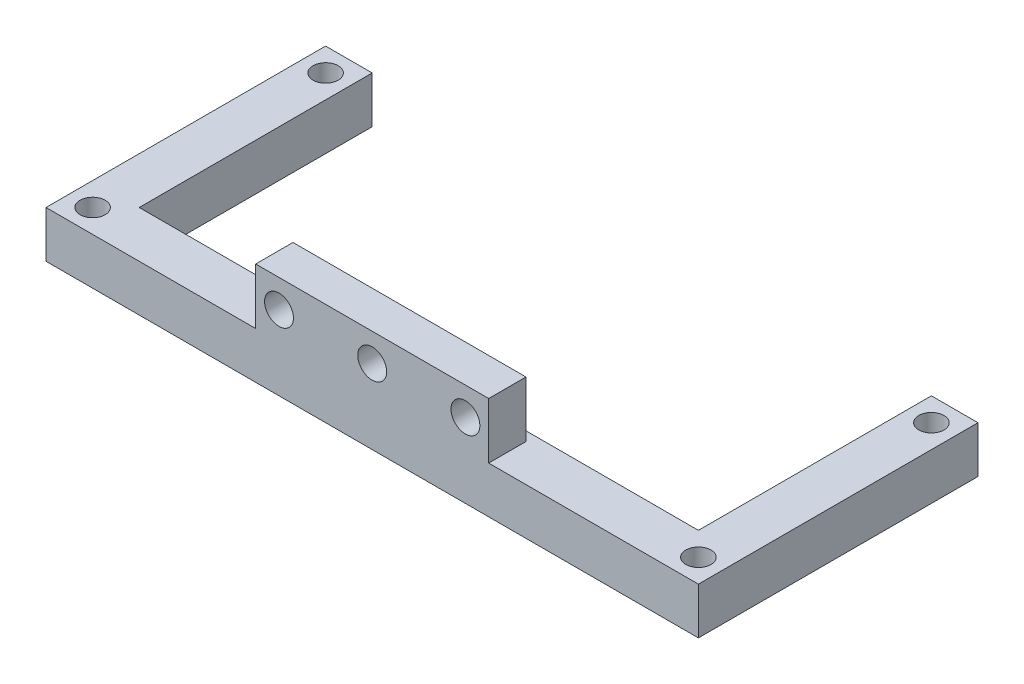
ISO-10303-21;
HEADER;
FILE_DESCRIPTION(('STEP AP214'),'2;1');
FILE_NAME('part.step','',(''),(''),'','','');
FILE_SCHEMA(('AUTOMOTIVE_DESIGN { 1 0 10303 214 1 1 1 1 }'));
ENDSEC;
DATA;
#1=APPLICATION_CONTEXT('core data for automotive mechanical design processes');
#2=APPLICATION_PROTOCOL_DEFINITION('international standard','automotive_design',2000,#1);
#3=PRODUCT_CONTEXT('',#1,'mechanical');
#4=PRODUCT('Part','Part','',(#3));
#5=PRODUCT_RELATED_PRODUCT_CATEGORY('part','',(#4));
#6=PRODUCT_DEFINITION_FORMATION('','',#4);
#7=PRODUCT_DEFINITION_CONTEXT('part definition',#1,'design');
#8=PRODUCT_DEFINITION('design','',#6,#7);
#9=PRODUCT_DEFINITION_SHAPE('','',#8);
#10=(LENGTH_UNIT() NAMED_UNIT(*) SI_UNIT(.MILLI.,.METRE.));
#11=(NAMED_UNIT(*) PLANE_ANGLE_UNIT() SI_UNIT($,.RADIAN.));
#12=(NAMED_UNIT(*) SI_UNIT($,.STERADIAN.) SOLID_ANGLE_UNIT());
#13=UNCERTAINTY_MEASURE_WITH_UNIT(LENGTH_MEASURE(1.E-05),#10,'distance_accuracy_value','');
#14=(GEOMETRIC_REPRESENTATION_CONTEXT(3) GLOBAL_UNCERTAINTY_ASSIGNED_CONTEXT((#13)) GLOBAL_UNIT_ASSIGNED_CONTEXT((#10,
#11,#12)) REPRESENTATION_CONTEXT('',''));
#15=CARTESIAN_POINT('',(0.,0.,0.));
#16=DIRECTION('',(0.,0.,1.));
#17=DIRECTION('',(1.,0.,0.));
#18=AXIS2_PLACEMENT_3D('',#15,#16,#17);
#19=CARTESIAN_POINT('',(35.,5.,-15.));
#20=DIRECTION('',(0.,0.,1.));
#21=DIRECTION('',(1.,0.,0.));
#22=AXIS2_PLACEMENT_3D('',#19,#20,#21);
#23=PLANE('',#22);
#24=DIRECTION('',(-1.,0.,0.));
#25=VECTOR('',#24,1.);
#26=CARTESIAN_POINT('',(35.,0.,-15.));
#27=LINE('',#26,#25);
#28=CARTESIAN_POINT('',(35.,0.,-15.));
#29=VERTEX_POINT('',#28);
#30=CARTESIAN_POINT('',(30.,0.,-15.));
#31=VERTEX_POINT('',#30);
#32=EDGE_CURVE('E159',#29,#31,#27,.T.);
#33=ORIENTED_EDGE('',*,*,#32,.T.);
#34=DIRECTION('',(0.,1.,0.));
#35=VECTOR('',#34,1.);
#36=CARTESIAN_POINT('',(30.,0.,-15.));
#37=LINE('',#36,#35);
#38=CARTESIAN_POINT('',(30.,5.,-15.));
#39=VERTEX_POINT('',#38);
#40=EDGE_CURVE('E194',#31,#39,#37,.T.);
#41=ORIENTED_EDGE('',*,*,#40,.T.);
#42=DIRECTION('',(-1.,0.,0.));
#43=VECTOR('',#42,1.);
#44=CARTESIAN_POINT('',(35.,5.,-15.));
#45=LINE('',#44,#43);
#46=CARTESIAN_POINT('',(35.,5.,-15.));
#47=VERTEX_POINT('',#46);
#48=EDGE_CURVE('E174',#47,#39,#45,.T.);
#49=ORIENTED_EDGE('',*,*,#48,.F.);
#50=DIRECTION('',(0.,-1.,0.));
#51=VECTOR('',#50,1.);
#52=CARTESIAN_POINT('',(35.,5.,-15.));
#53=LINE('',#52,#51);
#54=EDGE_CURVE('E173',#47,#29,#53,.T.);
#55=ORIENTED_EDGE('',*,*,#54,.T.);
#56=EDGE_LOOP('',(#33,#41,#49,#55));
#57=FACE_BOUND('',#56,.T.);
#58=ADVANCED_FACE('F43',(#57),#23,.F.);
#59=CARTESIAN_POINT('',(-35.,5.,15.));
#60=DIRECTION('',(1.,0.,0.));
#61=DIRECTION('',(0.,0.,-1.));
#62=AXIS2_PLACEMENT_3D('',#59,#60,#61);
#63=PLANE('',#62);
#64=DIRECTION('',(0.,0.,1.));
#65=VECTOR('',#64,1.);
#66=CARTESIAN_POINT('',(-35.,0.,15.));
#67=LINE('',#66,#65);
#68=CARTESIAN_POINT('',(-35.,0.,-15.));
#69=VERTEX_POINT('',#68);
#70=CARTESIAN_POINT('',(-35.,0.,15.));
#71=VERTEX_POINT('',#70);
#72=EDGE_CURVE('E157',#69,#71,#67,.T.);
#73=ORIENTED_EDGE('',*,*,#72,.T.);
#74=DIRECTION('',(0.,-1.,0.));
#75=VECTOR('',#74,1.);
#76=CARTESIAN_POINT('',(-35.,5.,15.));
#77=LINE('',#76,#75);
#78=CARTESIAN_POINT('',(-35.,5.,15.));
#79=VERTEX_POINT('',#78);
#80=EDGE_CURVE('E11',#79,#71,#77,.T.);
#81=ORIENTED_EDGE('',*,*,#80,.F.);
#82=DIRECTION('',(0.,0.,1.));
#83=VECTOR('',#82,1.);
#84=CARTESIAN_POINT('',(-35.,5.,15.));
#85=LINE('',#84,#83);
#86=CARTESIAN_POINT('',(-35.,5.,-15.));
#87=VERTEX_POINT('',#86);
#88=EDGE_CURVE('E165',#87,#79,#85,.T.);
#89=ORIENTED_EDGE('',*,*,#88,.F.);
#90=DIRECTION('',(0.,-1.,0.));
#91=VECTOR('',#90,1.);
#92=CARTESIAN_POINT('',(-35.,5.,-15.));
#93=LINE('',#92,#91);
#94=EDGE_CURVE('E170',#87,#69,#93,.T.);
#95=ORIENTED_EDGE('',*,*,#94,.T.);
#96=EDGE_LOOP('',(#73,#81,#89,#95));
#97=FACE_BOUND('',#96,.T.);
#98=ADVANCED_FACE('F45',(#97),#63,.F.);
#99=CARTESIAN_POINT('',(35.,5.,15.));
#100=DIRECTION('',(0.,0.,-1.));
#101=DIRECTION('',(-1.,0.,0.));
#102=AXIS2_PLACEMENT_3D('',#99,#100,#101);
#103=PLANE('',#102);
#104=CARTESIAN_POINT('',(10.,8.,15.));
#105=DIRECTION('',(0.,0.,-1.));
#106=DIRECTION('',(-1.,0.,0.));
#107=AXIS2_PLACEMENT_3D('',#104,#105,#106);
#108=CIRCLE('',#107,1.55);
#109=CARTESIAN_POINT('',(8.45000000000001,8.,15.));
#110=VERTEX_POINT('',#109);
#111=EDGE_CURVE('E300',#110,#110,#108,.T.);
#112=ORIENTED_EDGE('',*,*,#111,.T.);
#113=EDGE_LOOP('',(#112));
#114=FACE_BOUND('',#113,.T.);
#115=CARTESIAN_POINT('',(0.,8.,15.));
#116=DIRECTION('',(0.,0.,-1.));
#117=DIRECTION('',(-1.,0.,0.));
#118=AXIS2_PLACEMENT_3D('',#115,#116,#117);
#119=CIRCLE('',#118,1.55);
#120=CARTESIAN_POINT('',(-1.54999999999999,8.,15.));
#121=VERTEX_POINT('',#120);
#122=EDGE_CURVE('E304',#121,#121,#119,.T.);
#123=ORIENTED_EDGE('',*,*,#122,.T.);
#124=EDGE_LOOP('',(#123));
#125=FACE_BOUND('',#124,.T.);
#126=CARTESIAN_POINT('',(-9.99999999999999,8.,15.));
#127=DIRECTION('',(0.,0.,-1.));
#128=DIRECTION('',(-1.,0.,0.));
#129=AXIS2_PLACEMENT_3D('',#126,#127,#128);
#130=CIRCLE('',#129,1.55);
#131=CARTESIAN_POINT('',(-11.55,8.,15.));
#132=VERTEX_POINT('',#131);
#133=EDGE_CURVE('E307',#132,#132,#130,.T.);
#134=ORIENTED_EDGE('',*,*,#133,.T.);
#135=EDGE_LOOP('',(#134));
#136=FACE_BOUND('',#135,.T.);
#137=DIRECTION('',(1.,0.,0.));
#138=VECTOR('',#137,1.);
#139=CARTESIAN_POINT('',(35.,0.,15.));
#140=LINE('',#139,#138);
#141=CARTESIAN_POINT('',(35.,0.,15.));
#142=VERTEX_POINT('',#141);
#143=EDGE_CURVE('E166',#71,#142,#140,.T.);
#144=ORIENTED_EDGE('',*,*,#143,.T.);
#145=DIRECTION('',(0.,-1.,0.));
#146=VECTOR('',#145,1.);
#147=CARTESIAN_POINT('',(35.,5.,15.));
#148=LINE('',#147,#146);
#149=CARTESIAN_POINT('',(35.,5.,15.));
#150=VERTEX_POINT('',#149);
#151=EDGE_CURVE('E52',#150,#142,#148,.T.);
#152=ORIENTED_EDGE('',*,*,#151,.F.);
#153=DIRECTION('',(1.,0.,0.));
#154=VECTOR('',#153,1.);
#155=CARTESIAN_POINT('',(35.,5.,15.));
#156=LINE('',#155,#154);
#157=CARTESIAN_POINT('',(12.5,5.,15.));
#158=VERTEX_POINT('',#157);
#159=EDGE_CURVE('E214',#158,#150,#156,.T.);
#160=ORIENTED_EDGE('',*,*,#159,.F.);
#161=DIRECTION('',(0.,-1.,0.));
#162=VECTOR('',#161,1.);
#163=CARTESIAN_POINT('',(12.5,11.,15.));
#164=LINE('',#163,#162);
#165=CARTESIAN_POINT('',(12.5,11.,15.));
#166=VERTEX_POINT('',#165);
#167=EDGE_CURVE('E229',#166,#158,#164,.T.);
#168=ORIENTED_EDGE('',*,*,#167,.F.);
#169=DIRECTION('',(1.,0.,0.));
#170=VECTOR('',#169,1.);
#171=CARTESIAN_POINT('',(-12.5,11.,15.));
#172=LINE('',#171,#170);
#173=CARTESIAN_POINT('',(-12.5,11.,15.));
#174=VERTEX_POINT('',#173);
#175=EDGE_CURVE('E320',#174,#166,#172,.T.);
#176=ORIENTED_EDGE('',*,*,#175,.F.);
#177=DIRECTION('',(0.,-1.,0.));
#178=VECTOR('',#177,1.);
#179=CARTESIAN_POINT('',(-12.5,11.,15.));
#180=LINE('',#179,#178);
#181=CARTESIAN_POINT('',(-12.5,5.,15.));
#182=VERTEX_POINT('',#181);
#183=EDGE_CURVE('E331',#174,#182,#180,.T.);
#184=ORIENTED_EDGE('',*,*,#183,.T.);
#185=EDGE_CURVE('E209',#79,#182,#156,.T.);
#186=ORIENTED_EDGE('',*,*,#185,.F.);
#187=ORIENTED_EDGE('',*,*,#80,.T.);
#188=EDGE_LOOP('',(#144,#152,#160,#168,#176,#184,#186,#187));
#189=FACE_BOUND('',#188,.T.);
#190=ADVANCED_FACE('F206',(#114,#125,#136,#189),#103,.F.);
#191=CARTESIAN_POINT('',(35.,5.,15.));
#192=DIRECTION('',(-1.,0.,0.));
#193=DIRECTION('',(0.,0.,1.));
#194=AXIS2_PLACEMENT_3D('',#191,#192,#193);
#195=PLANE('',#194);
#196=DIRECTION('',(0.,0.,-1.));
#197=VECTOR('',#196,1.);
#198=CARTESIAN_POINT('',(35.,0.,15.));
#199=LINE('',#198,#197);
#200=EDGE_CURVE('E160',#142,#29,#199,.T.);
#201=ORIENTED_EDGE('',*,*,#200,.T.);
#202=ORIENTED_EDGE('',*,*,#54,.F.);
#203=DIRECTION('',(0.,0.,-1.));
#204=VECTOR('',#203,1.);
#205=CARTESIAN_POINT('',(35.,5.,15.));
#206=LINE('',#205,#204);
#207=EDGE_CURVE('E185',#150,#47,#206,.T.);
#208=ORIENTED_EDGE('',*,*,#207,.F.);
#209=ORIENTED_EDGE('',*,*,#151,.T.);
#210=EDGE_LOOP('',(#201,#202,#208,#209));
#211=FACE_BOUND('',#210,.T.);
#212=ADVANCED_FACE('F183',(#211),#195,.F.);
#213=CARTESIAN_POINT('',(-30.,5.,-15.));
#214=VERTEX_POINT('',#213);
#215=EDGE_CURVE('E150',#214,#87,#45,.T.);
#216=ORIENTED_EDGE('',*,*,#215,.F.);
#217=DIRECTION('',(0.,1.,0.));
#218=VECTOR('',#217,1.);
#219=CARTESIAN_POINT('',(-30.,0.,-15.));
#220=LINE('',#219,#218);
#221=CARTESIAN_POINT('',(-30.,0.,-15.));
#222=VERTEX_POINT('',#221);
#223=EDGE_CURVE('E136',#222,#214,#220,.T.);
#224=ORIENTED_EDGE('',*,*,#223,.F.);
#225=EDGE_CURVE('E148',#222,#69,#27,.T.);
#226=ORIENTED_EDGE('',*,*,#225,.T.);
#227=ORIENTED_EDGE('',*,*,#94,.F.);
#228=EDGE_LOOP('',(#216,#224,#226,#227));
#229=FACE_BOUND('',#228,.T.);
#230=ADVANCED_FACE('F146',(#229),#23,.F.);
#231=CARTESIAN_POINT('',(0.,5.,0.));
#232=DIRECTION('',(0.,1.,0.));
#233=DIRECTION('',(0.,0.,1.));
#234=AXIS2_PLACEMENT_3D('',#231,#232,#233);
#235=PLANE('',#234);
#236=DIRECTION('',(0.,0.,-1.));
#237=VECTOR('',#236,1.);
#238=CARTESIAN_POINT('',(30.,5.,9.99999999999998));
#239=LINE('',#238,#237);
#240=CARTESIAN_POINT('',(30.,5.,9.99999999999998));
#241=VERTEX_POINT('',#240);
#242=EDGE_CURVE('E142',#241,#39,#239,.T.);
#243=ORIENTED_EDGE('',*,*,#242,.F.);
#244=DIRECTION('',(1.,0.,0.));
#245=VECTOR('',#244,1.);
#246=CARTESIAN_POINT('',(-30.,5.,9.99999999999999));
#247=LINE('',#246,#245);
#248=CARTESIAN_POINT('',(-30.,5.,9.99999999999999));
#249=VERTEX_POINT('',#248);
#250=EDGE_CURVE('E562',#249,#241,#247,.T.);
#251=ORIENTED_EDGE('',*,*,#250,.F.);
#252=DIRECTION('',(0.,0.,1.));
#253=VECTOR('',#252,1.);
#254=CARTESIAN_POINT('',(-30.,5.,-15.));
#255=LINE('',#254,#253);
#256=EDGE_CURVE('E564',#214,#249,#255,.T.);
#257=ORIENTED_EDGE('',*,*,#256,.F.);
#258=ORIENTED_EDGE('',*,*,#215,.T.);
#259=ORIENTED_EDGE('',*,*,#88,.T.);
#260=ORIENTED_EDGE('',*,*,#185,.T.);
#261=DIRECTION('',(0.,0.,1.));
#262=VECTOR('',#261,1.);
#263=CARTESIAN_POINT('',(-12.5,5.,11.));
#264=LINE('',#263,#262);
#265=CARTESIAN_POINT('',(-12.5,5.,11.));
#266=VERTEX_POINT('',#265);
#267=EDGE_CURVE('E67',#266,#182,#264,.T.);
#268=ORIENTED_EDGE('',*,*,#267,.F.);
#269=DIRECTION('',(-1.,0.,0.));
#270=VECTOR('',#269,1.);
#271=CARTESIAN_POINT('',(12.5,5.,11.));
#272=LINE('',#271,#270);
#273=CARTESIAN_POINT('',(12.5,5.,11.));
#274=VERTEX_POINT('',#273);
#275=EDGE_CURVE('E334',#274,#266,#272,.T.);
#276=ORIENTED_EDGE('',*,*,#275,.F.);
#277=DIRECTION('',(0.,0.,-1.));
#278=VECTOR('',#277,1.);
#279=CARTESIAN_POINT('',(12.5,5.,15.));
#280=LINE('',#279,#278);
#281=EDGE_CURVE('E225',#158,#274,#280,.T.);
#282=ORIENTED_EDGE('',*,*,#281,.F.);
#283=ORIENTED_EDGE('',*,*,#159,.T.);
#284=ORIENTED_EDGE('',*,*,#207,.T.);
#285=ORIENTED_EDGE('',*,*,#48,.T.);
#286=EDGE_LOOP('',(#243,#251,#257,#258,#259,#260,#268,#276,#282,#283,#284,#285));
#287=FACE_BOUND('',#286,.T.);
#288=CARTESIAN_POINT('',(32.5,5.,-12.5));
#289=DIRECTION('',(0.,1.,0.));
#290=DIRECTION('',(0.,0.,1.));
#291=AXIS2_PLACEMENT_3D('',#288,#289,#290);
#292=CIRCLE('',#291,1.35);
#293=CARTESIAN_POINT('',(32.5,5.,-11.15));
#294=VERTEX_POINT('',#293);
#295=EDGE_CURVE('E243',#294,#294,#292,.T.);
#296=ORIENTED_EDGE('',*,*,#295,.F.);
#297=EDGE_LOOP('',(#296));
#298=FACE_BOUND('',#297,.T.);
#299=CARTESIAN_POINT('',(32.5,5.,12.5));
#300=DIRECTION('',(0.,1.,0.));
#301=DIRECTION('',(0.,0.,1.));
#302=AXIS2_PLACEMENT_3D('',#299,#300,#301);
#303=CIRCLE('',#302,1.35);
#304=CARTESIAN_POINT('',(32.5,5.,13.85));
#305=VERTEX_POINT('',#304);
#306=EDGE_CURVE('E257',#305,#305,#303,.T.);
#307=ORIENTED_EDGE('',*,*,#306,.F.);
#308=EDGE_LOOP('',(#307));
#309=FACE_BOUND('',#308,.T.);
#310=CARTESIAN_POINT('',(-32.5,5.,12.5));
#311=DIRECTION('',(0.,1.,0.));
#312=DIRECTION('',(0.,0.,1.));
#313=AXIS2_PLACEMENT_3D('',#310,#311,#312);
#314=CIRCLE('',#313,1.35);
#315=CARTESIAN_POINT('',(-32.5,5.,13.85));
#316=VERTEX_POINT('',#315);
#317=EDGE_CURVE('E249',#316,#316,#314,.T.);
#318=ORIENTED_EDGE('',*,*,#317,.F.);
#319=EDGE_LOOP('',(#318));
#320=FACE_BOUND('',#319,.T.);
#321=CARTESIAN_POINT('',(-32.5,5.,-12.5));
#322=DIRECTION('',(0.,1.,0.));
#323=DIRECTION('',(0.,0.,1.));
#324=AXIS2_PLACEMENT_3D('',#321,#322,#323);
#325=CIRCLE('',#324,1.35);
#326=CARTESIAN_POINT('',(-32.5,5.,-11.15));
#327=VERTEX_POINT('',#326);
#328=EDGE_CURVE('E218',#327,#327,#325,.T.);
#329=ORIENTED_EDGE('',*,*,#328,.F.);
#330=EDGE_LOOP('',(#329));
#331=FACE_BOUND('',#330,.T.);
#332=ADVANCED_FACE('F222',(#287,#298,#309,#320,#331),#235,.T.);
#333=CARTESIAN_POINT('',(0.,0.,0.));
#334=DIRECTION('',(0.,1.,0.));
#335=DIRECTION('',(0.,0.,1.));
#336=AXIS2_PLACEMENT_3D('',#333,#334,#335);
#337=PLANE('',#336);
#338=CARTESIAN_POINT('',(32.5,0.,-12.5));
#339=DIRECTION('',(0.,1.,0.));
#340=DIRECTION('',(0.,0.,1.));
#341=AXIS2_PLACEMENT_3D('',#338,#339,#340);
#342=CIRCLE('',#341,1.35);
#343=CARTESIAN_POINT('',(32.5,0.,-11.15));
#344=VERTEX_POINT('',#343);
#345=EDGE_CURVE('E237',#344,#344,#342,.T.);
#346=ORIENTED_EDGE('',*,*,#345,.T.);
#347=EDGE_LOOP('',(#346));
#348=FACE_BOUND('',#347,.T.);
#349=CARTESIAN_POINT('',(32.5,0.,12.5));
#350=DIRECTION('',(0.,1.,0.));
#351=DIRECTION('',(0.,0.,1.));
#352=AXIS2_PLACEMENT_3D('',#349,#350,#351);
#353=CIRCLE('',#352,1.35);
#354=CARTESIAN_POINT('',(32.5,0.,13.85));
#355=VERTEX_POINT('',#354);
#356=EDGE_CURVE('E261',#355,#355,#353,.T.);
#357=ORIENTED_EDGE('',*,*,#356,.T.);
#358=EDGE_LOOP('',(#357));
#359=FACE_BOUND('',#358,.T.);
#360=CARTESIAN_POINT('',(-32.5,0.,12.5));
#361=DIRECTION('',(0.,1.,0.));
#362=DIRECTION('',(0.,0.,1.));
#363=AXIS2_PLACEMENT_3D('',#360,#361,#362);
#364=CIRCLE('',#363,1.35);
#365=CARTESIAN_POINT('',(-32.5,0.,13.85));
#366=VERTEX_POINT('',#365);
#367=EDGE_CURVE('E253',#366,#366,#364,.T.);
#368=ORIENTED_EDGE('',*,*,#367,.T.);
#369=EDGE_LOOP('',(#368));
#370=FACE_BOUND('',#369,.T.);
#371=CARTESIAN_POINT('',(-32.5,0.,-12.5));
#372=DIRECTION('',(0.,1.,0.));
#373=DIRECTION('',(0.,0.,1.));
#374=AXIS2_PLACEMENT_3D('',#371,#372,#373);
#375=CIRCLE('',#374,1.35);
#376=CARTESIAN_POINT('',(-32.5,0.,-11.15));
#377=VERTEX_POINT('',#376);
#378=EDGE_CURVE('E204',#377,#377,#375,.T.);
#379=ORIENTED_EDGE('',*,*,#378,.T.);
#380=EDGE_LOOP('',(#379));
#381=FACE_BOUND('',#380,.T.);
#382=DIRECTION('',(1.,0.,0.));
#383=VECTOR('',#382,1.);
#384=CARTESIAN_POINT('',(-30.,0.,9.99999999999999));
#385=LINE('',#384,#383);
#386=CARTESIAN_POINT('',(-30.,0.,9.99999999999999));
#387=VERTEX_POINT('',#386);
#388=CARTESIAN_POINT('',(30.,0.,9.99999999999998));
#389=VERTEX_POINT('',#388);
#390=EDGE_CURVE('E59',#387,#389,#385,.T.);
#391=ORIENTED_EDGE('',*,*,#390,.T.);
#392=DIRECTION('',(0.,0.,-1.));
#393=VECTOR('',#392,1.);
#394=CARTESIAN_POINT('',(30.,0.,9.99999999999998));
#395=LINE('',#394,#393);
#396=EDGE_CURVE('E152',#389,#31,#395,.T.);
#397=ORIENTED_EDGE('',*,*,#396,.T.);
#398=ORIENTED_EDGE('',*,*,#32,.F.);
#399=ORIENTED_EDGE('',*,*,#200,.F.);
#400=ORIENTED_EDGE('',*,*,#143,.F.);
#401=ORIENTED_EDGE('',*,*,#72,.F.);
#402=ORIENTED_EDGE('',*,*,#225,.F.);
#403=DIRECTION('',(0.,0.,1.));
#404=VECTOR('',#403,1.);
#405=CARTESIAN_POINT('',(-30.,0.,-15.));
#406=LINE('',#405,#404);
#407=EDGE_CURVE('E132',#222,#387,#406,.T.);
#408=ORIENTED_EDGE('',*,*,#407,.T.);
#409=EDGE_LOOP('',(#391,#397,#398,#399,#400,#401,#402,#408));
#410=FACE_BOUND('',#409,.T.);
#411=ADVANCED_FACE('F155',(#348,#359,#370,#381,#410),#337,.F.);
#412=CARTESIAN_POINT('',(-32.5,0.,-12.5));
#413=DIRECTION('',(0.,1.,0.));
#414=DIRECTION('',(0.,0.,1.));
#415=AXIS2_PLACEMENT_3D('',#412,#413,#414);
#416=CYLINDRICAL_SURFACE('',#415,1.35);
#417=ORIENTED_EDGE('',*,*,#378,.F.);
#418=EDGE_LOOP('',(#417));
#419=FACE_BOUND('',#418,.T.);
#420=ORIENTED_EDGE('',*,*,#328,.T.);
#421=EDGE_LOOP('',(#420));
#422=FACE_BOUND('',#421,.T.);
#423=ADVANCED_FACE('F275',(#419,#422),#416,.F.);
#424=CARTESIAN_POINT('',(-32.5,0.,12.5));
#425=DIRECTION('',(0.,1.,0.));
#426=DIRECTION('',(0.,0.,1.));
#427=AXIS2_PLACEMENT_3D('',#424,#425,#426);
#428=CYLINDRICAL_SURFACE('',#427,1.35);
#429=ORIENTED_EDGE('',*,*,#367,.F.);
#430=EDGE_LOOP('',(#429));
#431=FACE_BOUND('',#430,.T.);
#432=ORIENTED_EDGE('',*,*,#317,.T.);
#433=EDGE_LOOP('',(#432));
#434=FACE_BOUND('',#433,.T.);
#435=ADVANCED_FACE('F370',(#431,#434),#428,.F.);
#436=CARTESIAN_POINT('',(32.5,0.,12.5));
#437=DIRECTION('',(0.,1.,0.));
#438=DIRECTION('',(0.,0.,1.));
#439=AXIS2_PLACEMENT_3D('',#436,#437,#438);
#440=CYLINDRICAL_SURFACE('',#439,1.35);
#441=ORIENTED_EDGE('',*,*,#356,.F.);
#442=EDGE_LOOP('',(#441));
#443=FACE_BOUND('',#442,.T.);
#444=ORIENTED_EDGE('',*,*,#306,.T.);
#445=EDGE_LOOP('',(#444));
#446=FACE_BOUND('',#445,.T.);
#447=ADVANCED_FACE('F373',(#443,#446),#440,.F.);
#448=CARTESIAN_POINT('',(32.5,0.,-12.5));
#449=DIRECTION('',(0.,1.,0.));
#450=DIRECTION('',(0.,0.,1.));
#451=AXIS2_PLACEMENT_3D('',#448,#449,#450);
#452=CYLINDRICAL_SURFACE('',#451,1.35);
#453=ORIENTED_EDGE('',*,*,#345,.F.);
#454=EDGE_LOOP('',(#453));
#455=FACE_BOUND('',#454,.T.);
#456=ORIENTED_EDGE('',*,*,#295,.T.);
#457=EDGE_LOOP('',(#456));
#458=FACE_BOUND('',#457,.T.);
#459=ADVANCED_FACE('F369',(#455,#458),#452,.F.);
#460=CARTESIAN_POINT('',(12.5,11.,15.));
#461=DIRECTION('',(-1.,0.,0.));
#462=DIRECTION('',(0.,0.,1.));
#463=AXIS2_PLACEMENT_3D('',#460,#461,#462);
#464=PLANE('',#463);
#465=ORIENTED_EDGE('',*,*,#281,.T.);
#466=DIRECTION('',(0.,-1.,0.));
#467=VECTOR('',#466,1.);
#468=CARTESIAN_POINT('',(12.5,11.,11.));
#469=LINE('',#468,#467);
#470=CARTESIAN_POINT('',(12.5,11.,11.));
#471=VERTEX_POINT('',#470);
#472=EDGE_CURVE('E238',#471,#274,#469,.T.);
#473=ORIENTED_EDGE('',*,*,#472,.F.);
#474=DIRECTION('',(0.,0.,-1.));
#475=VECTOR('',#474,1.);
#476=CARTESIAN_POINT('',(12.5,11.,15.));
#477=LINE('',#476,#475);
#478=EDGE_CURVE('E234',#166,#471,#477,.T.);
#479=ORIENTED_EDGE('',*,*,#478,.F.);
#480=ORIENTED_EDGE('',*,*,#167,.T.);
#481=EDGE_LOOP('',(#465,#473,#479,#480));
#482=FACE_BOUND('',#481,.T.);
#483=ADVANCED_FACE('F231',(#482),#464,.F.);
#484=CARTESIAN_POINT('',(12.5,11.,11.));
#485=DIRECTION('',(0.,0.,1.));
#486=DIRECTION('',(1.,0.,0.));
#487=AXIS2_PLACEMENT_3D('',#484,#485,#486);
#488=PLANE('',#487);
#489=CARTESIAN_POINT('',(10.,8.,11.));
#490=DIRECTION('',(0.,0.,-1.));
#491=DIRECTION('',(-1.,0.,0.));
#492=AXIS2_PLACEMENT_3D('',#489,#490,#491);
#493=CIRCLE('',#492,1.55);
#494=CARTESIAN_POINT('',(8.45000000000001,8.,11.));
#495=VERTEX_POINT('',#494);
#496=EDGE_CURVE('E576',#495,#495,#493,.T.);
#497=ORIENTED_EDGE('',*,*,#496,.F.);
#498=EDGE_LOOP('',(#497));
#499=FACE_BOUND('',#498,.T.);
#500=CARTESIAN_POINT('',(0.,8.,11.));
#501=DIRECTION('',(0.,0.,-1.));
#502=DIRECTION('',(-1.,0.,0.));
#503=AXIS2_PLACEMENT_3D('',#500,#501,#502);
#504=CIRCLE('',#503,1.55);
#505=CARTESIAN_POINT('',(-1.54999999999999,8.,11.));
#506=VERTEX_POINT('',#505);
#507=EDGE_CURVE('E580',#506,#506,#504,.T.);
#508=ORIENTED_EDGE('',*,*,#507,.F.);
#509=EDGE_LOOP('',(#508));
#510=FACE_BOUND('',#509,.T.);
#511=CARTESIAN_POINT('',(-9.99999999999999,8.,11.));
#512=DIRECTION('',(0.,0.,-1.));
#513=DIRECTION('',(-1.,0.,0.));
#514=AXIS2_PLACEMENT_3D('',#511,#512,#513);
#515=CIRCLE('',#514,1.55);
#516=CARTESIAN_POINT('',(-11.55,8.,11.));
#517=VERTEX_POINT('',#516);
#518=EDGE_CURVE('E310',#517,#517,#515,.T.);
#519=ORIENTED_EDGE('',*,*,#518,.F.);
#520=EDGE_LOOP('',(#519));
#521=FACE_BOUND('',#520,.T.);
#522=ORIENTED_EDGE('',*,*,#275,.T.);
#523=DIRECTION('',(0.,-1.,0.));
#524=VECTOR('',#523,1.);
#525=CARTESIAN_POINT('',(-12.5,11.,11.));
#526=LINE('',#525,#524);
#527=CARTESIAN_POINT('',(-12.5,11.,11.));
#528=VERTEX_POINT('',#527);
#529=EDGE_CURVE('E245',#528,#266,#526,.T.);
#530=ORIENTED_EDGE('',*,*,#529,.F.);
#531=DIRECTION('',(-1.,0.,0.));
#532=VECTOR('',#531,1.);
#533=CARTESIAN_POINT('',(12.5,11.,11.));
#534=LINE('',#533,#532);
#535=EDGE_CURVE('E325',#471,#528,#534,.T.);
#536=ORIENTED_EDGE('',*,*,#535,.F.);
#537=ORIENTED_EDGE('',*,*,#472,.T.);
#538=EDGE_LOOP('',(#522,#530,#536,#537));
#539=FACE_BOUND('',#538,.T.);
#540=ADVANCED_FACE('F349',(#499,#510,#521,#539),#488,.F.);
#541=CARTESIAN_POINT('',(-12.5,11.,11.));
#542=DIRECTION('',(1.,0.,0.));
#543=DIRECTION('',(0.,0.,-1.));
#544=AXIS2_PLACEMENT_3D('',#541,#542,#543);
#545=PLANE('',#544);
#546=ORIENTED_EDGE('',*,*,#267,.T.);
#547=ORIENTED_EDGE('',*,*,#183,.F.);
#548=DIRECTION('',(0.,0.,1.));
#549=VECTOR('',#548,1.);
#550=CARTESIAN_POINT('',(-12.5,11.,11.));
#551=LINE('',#550,#549);
#552=EDGE_CURVE('E328',#528,#174,#551,.T.);
#553=ORIENTED_EDGE('',*,*,#552,.F.);
#554=ORIENTED_EDGE('',*,*,#529,.T.);
#555=EDGE_LOOP('',(#546,#547,#553,#554));
#556=FACE_BOUND('',#555,.T.);
#557=ADVANCED_FACE('F345',(#556),#545,.F.);
#558=CARTESIAN_POINT('',(0.,11.,0.));
#559=DIRECTION('',(0.,1.,0.));
#560=DIRECTION('',(0.,0.,1.));
#561=AXIS2_PLACEMENT_3D('',#558,#559,#560);
#562=PLANE('',#561);
#563=ORIENTED_EDGE('',*,*,#175,.T.);
#564=ORIENTED_EDGE('',*,*,#478,.T.);
#565=ORIENTED_EDGE('',*,*,#535,.T.);
#566=ORIENTED_EDGE('',*,*,#552,.T.);
#567=EDGE_LOOP('',(#563,#564,#565,#566));
#568=FACE_BOUND('',#567,.T.);
#569=ADVANCED_FACE('F351',(#568),#562,.T.);
#570=CARTESIAN_POINT('',(-9.99999999999999,8.,15.));
#571=DIRECTION('',(0.,0.,-1.));
#572=DIRECTION('',(-1.,0.,0.));
#573=AXIS2_PLACEMENT_3D('',#570,#571,#572);
#574=CYLINDRICAL_SURFACE('',#573,1.55);
#575=ORIENTED_EDGE('',*,*,#133,.F.);
#576=EDGE_LOOP('',(#575));
#577=FACE_BOUND('',#576,.T.);
#578=ORIENTED_EDGE('',*,*,#518,.T.);
#579=EDGE_LOOP('',(#578));
#580=FACE_BOUND('',#579,.T.);
#581=ADVANCED_FACE('F353',(#577,#580),#574,.F.);
#582=CARTESIAN_POINT('',(0.,8.,15.));
#583=DIRECTION('',(0.,0.,-1.));
#584=DIRECTION('',(-1.,0.,0.));
#585=AXIS2_PLACEMENT_3D('',#582,#583,#584);
#586=CYLINDRICAL_SURFACE('',#585,1.55);
#587=ORIENTED_EDGE('',*,*,#122,.F.);
#588=EDGE_LOOP('',(#587));
#589=FACE_BOUND('',#588,.T.);
#590=ORIENTED_EDGE('',*,*,#507,.T.);
#591=EDGE_LOOP('',(#590));
#592=FACE_BOUND('',#591,.T.);
#593=ADVANCED_FACE('F359',(#589,#592),#586,.F.);
#594=CARTESIAN_POINT('',(10.,8.,15.));
#595=DIRECTION('',(0.,0.,-1.));
#596=DIRECTION('',(-1.,0.,0.));
#597=AXIS2_PLACEMENT_3D('',#594,#595,#596);
#598=CYLINDRICAL_SURFACE('',#597,1.55);
#599=ORIENTED_EDGE('',*,*,#111,.F.);
#600=EDGE_LOOP('',(#599));
#601=FACE_BOUND('',#600,.T.);
#602=ORIENTED_EDGE('',*,*,#496,.T.);
#603=EDGE_LOOP('',(#602));
#604=FACE_BOUND('',#603,.T.);
#605=ADVANCED_FACE('F455',(#601,#604),#598,.F.);
#606=CARTESIAN_POINT('',(30.,0.,9.99999999999998));
#607=DIRECTION('',(1.,0.,0.));
#608=DIRECTION('',(0.,0.,-1.));
#609=AXIS2_PLACEMENT_3D('',#606,#607,#608);
#610=PLANE('',#609);
#611=ORIENTED_EDGE('',*,*,#242,.T.);
#612=ORIENTED_EDGE('',*,*,#40,.F.);
#613=ORIENTED_EDGE('',*,*,#396,.F.);
#614=DIRECTION('',(0.,1.,0.));
#615=VECTOR('',#614,1.);
#616=CARTESIAN_POINT('',(30.,0.,9.99999999999998));
#617=LINE('',#616,#615);
#618=EDGE_CURVE('E316',#389,#241,#617,.T.);
#619=ORIENTED_EDGE('',*,*,#618,.T.);
#620=EDGE_LOOP('',(#611,#612,#613,#619));
#621=FACE_BOUND('',#620,.T.);
#622=ADVANCED_FACE('F464',(#621),#610,.F.);
#623=CARTESIAN_POINT('',(-30.,0.,9.99999999999999));
#624=DIRECTION('',(0.,0.,1.));
#625=DIRECTION('',(1.,0.,0.));
#626=AXIS2_PLACEMENT_3D('',#623,#624,#625);
#627=PLANE('',#626);
#628=ORIENTED_EDGE('',*,*,#250,.T.);
#629=ORIENTED_EDGE('',*,*,#618,.F.);
#630=ORIENTED_EDGE('',*,*,#390,.F.);
#631=DIRECTION('',(0.,1.,0.));
#632=VECTOR('',#631,1.);
#633=CARTESIAN_POINT('',(-30.,0.,9.99999999999999));
#634=LINE('',#633,#632);
#635=EDGE_CURVE('E138',#387,#249,#634,.T.);
#636=ORIENTED_EDGE('',*,*,#635,.T.);
#637=EDGE_LOOP('',(#628,#629,#630,#636));
#638=FACE_BOUND('',#637,.T.);
#639=ADVANCED_FACE('F481',(#638),#627,.F.);
#640=CARTESIAN_POINT('',(-30.,0.,-15.));
#641=DIRECTION('',(-1.,0.,0.));
#642=DIRECTION('',(0.,0.,1.));
#643=AXIS2_PLACEMENT_3D('',#640,#641,#642);
#644=PLANE('',#643);
#645=ORIENTED_EDGE('',*,*,#256,.T.);
#646=ORIENTED_EDGE('',*,*,#635,.F.);
#647=ORIENTED_EDGE('',*,*,#407,.F.);
#648=ORIENTED_EDGE('',*,*,#223,.T.);
#649=EDGE_LOOP('',(#645,#646,#647,#648));
#650=FACE_BOUND('',#649,.T.);
#651=ADVANCED_FACE('F135',(#650),#644,.F.);
#652=CLOSED_SHELL('',(#58,#98,#190,#212,#230,#332,#411,#423,#435,#447,#459,#483,#540,#557,#569,
#581,#593,#605,#622,#639,#651));
#653=MANIFOLD_SOLID_BREP('B2',#652);
#654=ADVANCED_BREP_SHAPE_REPRESENTATION('',(#18,#653),#14);
#655=SHAPE_DEFINITION_REPRESENTATION(#9,#654);
ENDSEC;
END-ISO-10303-21;
